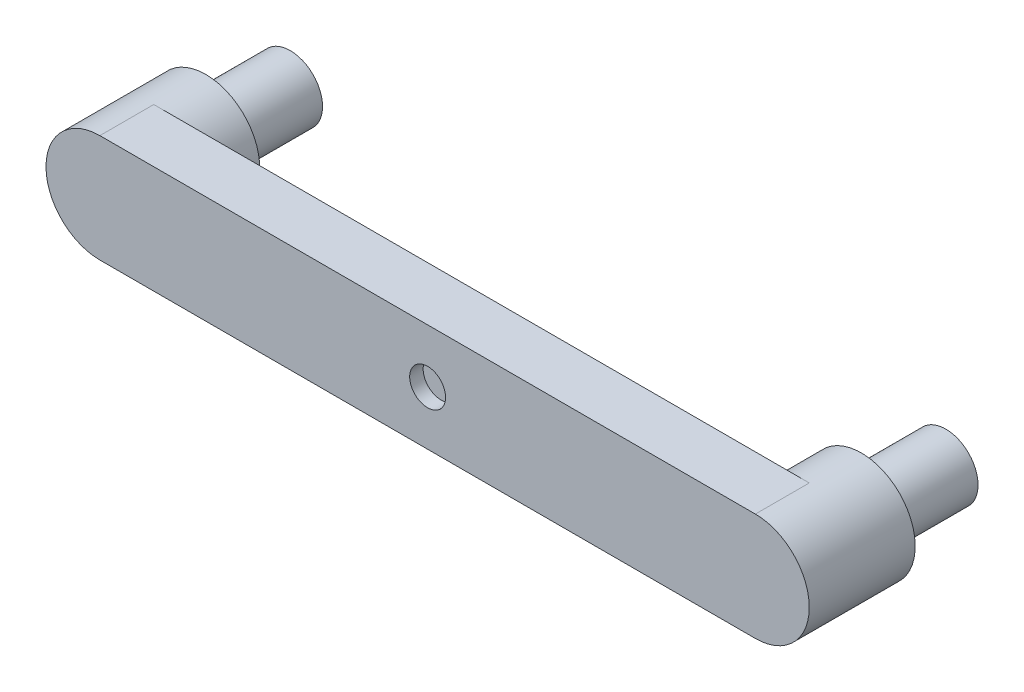
ISO-10303-21;
HEADER;
FILE_DESCRIPTION(('STEP AP214'),'2;1');
FILE_NAME('part.step','',(''),(''),'','','');
FILE_SCHEMA(('AUTOMOTIVE_DESIGN { 1 0 10303 214 1 1 1 1 }'));
ENDSEC;
DATA;
#1=APPLICATION_CONTEXT('core data for automotive mechanical design processes');
#2=APPLICATION_PROTOCOL_DEFINITION('international standard','automotive_design',2000,#1);
#3=PRODUCT_CONTEXT('',#1,'mechanical');
#4=PRODUCT('Part','Part','',(#3));
#5=PRODUCT_RELATED_PRODUCT_CATEGORY('part','',(#4));
#6=PRODUCT_DEFINITION_FORMATION('','',#4);
#7=PRODUCT_DEFINITION_CONTEXT('part definition',#1,'design');
#8=PRODUCT_DEFINITION('design','',#6,#7);
#9=PRODUCT_DEFINITION_SHAPE('','',#8);
#10=(LENGTH_UNIT() NAMED_UNIT(*) SI_UNIT(.MILLI.,.METRE.));
#11=(NAMED_UNIT(*) PLANE_ANGLE_UNIT() SI_UNIT($,.RADIAN.));
#12=(NAMED_UNIT(*) SI_UNIT($,.STERADIAN.) SOLID_ANGLE_UNIT());
#13=UNCERTAINTY_MEASURE_WITH_UNIT(LENGTH_MEASURE(1.E-05),#10,'distance_accuracy_value','');
#14=(GEOMETRIC_REPRESENTATION_CONTEXT(3) GLOBAL_UNCERTAINTY_ASSIGNED_CONTEXT((#13)) GLOBAL_UNIT_ASSIGNED_CONTEXT((#10,
#11,#12)) REPRESENTATION_CONTEXT('',''));
#15=CARTESIAN_POINT('',(0.,0.,0.));
#16=DIRECTION('',(0.,0.,1.));
#17=DIRECTION('',(1.,0.,0.));
#18=AXIS2_PLACEMENT_3D('',#15,#16,#17);
#19=CARTESIAN_POINT('',(0.,0.,-58.2842712474619));
#20=DIRECTION('',(0.,0.,1.));
#21=DIRECTION('',(1.,0.,0.));
#22=AXIS2_PLACEMENT_3D('',#19,#20,#21);
#23=CYLINDRICAL_SURFACE('',#22,10.);
#24=CARTESIAN_POINT('',(0.,0.,-7.50000000000001));
#25=DIRECTION('',(0.,0.,1.));
#26=DIRECTION('',(1.,0.,0.));
#27=AXIS2_PLACEMENT_3D('',#24,#25,#26);
#28=CIRCLE('',#27,10.);
#29=CARTESIAN_POINT('',(10.,0.,-7.50000000000001));
#30=VERTEX_POINT('',#29);
#31=EDGE_CURVE('E45',#30,#30,#28,.F.);
#32=ORIENTED_EDGE('',*,*,#31,.T.);
#33=EDGE_LOOP('',(#32));
#34=FACE_BOUND('',#33,.T.);
#35=CARTESIAN_POINT('',(0.,0.,0.));
#36=DIRECTION('',(0.,0.,1.));
#37=DIRECTION('',(1.,0.,0.));
#38=AXIS2_PLACEMENT_3D('',#35,#36,#37);
#39=CIRCLE('',#38,10.);
#40=CARTESIAN_POINT('',(10.,0.,0.));
#41=VERTEX_POINT('',#40);
#42=EDGE_CURVE('E170',#41,#41,#39,.T.);
#43=ORIENTED_EDGE('',*,*,#42,.T.);
#44=EDGE_LOOP('',(#43));
#45=FACE_BOUND('',#44,.T.);
#46=ADVANCED_FACE('F41',(#34,#45),#23,.F.);
#47=CARTESIAN_POINT('',(0.,-30.,-30.));
#48=DIRECTION('',(0.,-1.,0.));
#49=DIRECTION('',(1.,0.,0.));
#50=AXIS2_PLACEMENT_3D('',#47,#48,#49);
#51=PLANE('',#50);
#52=DIRECTION('',(0.,0.,-1.));
#53=VECTOR('',#52,1.);
#54=CARTESIAN_POINT('',(-30.,-30.,-22.5));
#55=LINE('',#54,#53);
#56=CARTESIAN_POINT('',(-30.,-30.,-7.50000000000001));
#57=VERTEX_POINT('',#56);
#58=CARTESIAN_POINT('',(-30.,-30.,-22.5));
#59=VERTEX_POINT('',#58);
#60=EDGE_CURVE('E59',#57,#59,#55,.T.);
#61=ORIENTED_EDGE('',*,*,#60,.F.);
#62=DIRECTION('',(-1.,0.,0.));
#63=VECTOR('',#62,1.);
#64=CARTESIAN_POINT('',(-30.,-30.,-7.50000000000001));
#65=LINE('',#64,#63);
#66=CARTESIAN_POINT('',(30.,-30.,-7.50000000000001));
#67=VERTEX_POINT('',#66);
#68=EDGE_CURVE('E153',#67,#57,#65,.T.);
#69=ORIENTED_EDGE('',*,*,#68,.F.);
#70=DIRECTION('',(0.,0.,1.));
#71=VECTOR('',#70,1.);
#72=CARTESIAN_POINT('',(30.,-30.,-22.5));
#73=LINE('',#72,#71);
#74=CARTESIAN_POINT('',(30.,-30.,-22.5));
#75=VERTEX_POINT('',#74);
#76=EDGE_CURVE('E242',#75,#67,#73,.T.);
#77=ORIENTED_EDGE('',*,*,#76,.F.);
#78=DIRECTION('',(1.,0.,0.));
#79=VECTOR('',#78,1.);
#80=CARTESIAN_POINT('',(-30.,-30.,-22.5));
#81=LINE('',#80,#79);
#82=EDGE_CURVE('E250',#59,#75,#81,.T.);
#83=ORIENTED_EDGE('',*,*,#82,.F.);
#84=EDGE_LOOP('',(#61,#69,#77,#83));
#85=FACE_BOUND('',#84,.T.);
#86=DIRECTION('',(1.,0.,0.));
#87=VECTOR('',#86,1.);
#88=CARTESIAN_POINT('',(0.,-30.,0.));
#89=LINE('',#88,#87);
#90=CARTESIAN_POINT('',(-182.5,-30.,0.));
#91=VERTEX_POINT('',#90);
#92=CARTESIAN_POINT('',(182.5,-29.9999999999999,0.));
#93=VERTEX_POINT('',#92);
#94=EDGE_CURVE('E102',#91,#93,#89,.T.);
#95=ORIENTED_EDGE('',*,*,#94,.F.);
#96=DIRECTION('',(0.,0.,1.));
#97=VECTOR('',#96,1.);
#98=CARTESIAN_POINT('',(-182.5,-30.,-30.));
#99=LINE('',#98,#97);
#100=CARTESIAN_POINT('',(-182.5,-30.,-30.));
#101=VERTEX_POINT('',#100);
#102=EDGE_CURVE('E88',#101,#91,#99,.T.);
#103=ORIENTED_EDGE('',*,*,#102,.F.);
#104=DIRECTION('',(1.,0.,0.));
#105=VECTOR('',#104,1.);
#106=CARTESIAN_POINT('',(0.,-30.,-30.));
#107=LINE('',#106,#105);
#108=CARTESIAN_POINT('',(182.5,-29.9999999999999,-30.));
#109=VERTEX_POINT('',#108);
#110=EDGE_CURVE('E117',#101,#109,#107,.T.);
#111=ORIENTED_EDGE('',*,*,#110,.T.);
#112=DIRECTION('',(0.,0.,1.));
#113=VECTOR('',#112,1.);
#114=CARTESIAN_POINT('',(182.5,-29.9999999999999,-30.));
#115=LINE('',#114,#113);
#116=EDGE_CURVE('E104',#109,#93,#115,.T.);
#117=ORIENTED_EDGE('',*,*,#116,.T.);
#118=EDGE_LOOP('',(#95,#103,#111,#117));
#119=FACE_BOUND('',#118,.T.);
#120=ADVANCED_FACE('F43',(#85,#119),#51,.T.);
#121=CARTESIAN_POINT('',(-182.5,0.,-30.));
#122=DIRECTION('',(0.,0.,1.));
#123=DIRECTION('',(1.,0.,0.));
#124=AXIS2_PLACEMENT_3D('',#121,#122,#123);
#125=CYLINDRICAL_SURFACE('',#124,30.);
#126=CARTESIAN_POINT('',(-182.5,0.,0.));
#127=DIRECTION('',(0.,0.,1.));
#128=DIRECTION('',(1.,0.,0.));
#129=AXIS2_PLACEMENT_3D('',#126,#127,#128);
#130=CIRCLE('',#129,30.);
#131=CARTESIAN_POINT('',(-182.5,30.,0.));
#132=VERTEX_POINT('',#131);
#133=EDGE_CURVE('E93',#132,#91,#130,.T.);
#134=ORIENTED_EDGE('',*,*,#133,.F.);
#135=DIRECTION('',(0.,0.,1.));
#136=VECTOR('',#135,1.);
#137=CARTESIAN_POINT('',(-182.5,30.,-30.));
#138=LINE('',#137,#136);
#139=CARTESIAN_POINT('',(-182.5,30.,-30.));
#140=VERTEX_POINT('',#139);
#141=EDGE_CURVE('E99',#140,#132,#138,.T.);
#142=ORIENTED_EDGE('',*,*,#141,.F.);
#143=CARTESIAN_POINT('',(-182.5,0.,-30.));
#144=DIRECTION('',(0.,0.,-1.));
#145=DIRECTION('',(-1.,0.,0.));
#146=AXIS2_PLACEMENT_3D('',#143,#144,#145);
#147=CIRCLE('',#146,30.);
#148=EDGE_CURVE('E68',#140,#101,#147,.T.);
#149=ORIENTED_EDGE('',*,*,#148,.T.);
#150=ORIENTED_EDGE('',*,*,#102,.T.);
#151=EDGE_LOOP('',(#134,#142,#149,#150));
#152=FACE_BOUND('',#151,.T.);
#153=CARTESIAN_POINT('',(-182.5,0.,-59.));
#154=DIRECTION('',(0.,0.,-1.));
#155=DIRECTION('',(-1.,0.,0.));
#156=AXIS2_PLACEMENT_3D('',#153,#154,#155);
#157=CIRCLE('',#156,30.);
#158=CARTESIAN_POINT('',(-212.5,0.,-59.));
#159=VERTEX_POINT('',#158);
#160=EDGE_CURVE('E181',#159,#159,#157,.T.);
#161=ORIENTED_EDGE('',*,*,#160,.F.);
#162=EDGE_LOOP('',(#161));
#163=FACE_BOUND('',#162,.T.);
#164=ADVANCED_FACE('F90',(#152,#163),#125,.T.);
#165=CARTESIAN_POINT('',(0.,30.,-30.));
#166=DIRECTION('',(0.,-1.,0.));
#167=DIRECTION('',(1.,0.,0.));
#168=AXIS2_PLACEMENT_3D('',#165,#166,#167);
#169=PLANE('',#168);
#170=DIRECTION('',(1.,0.,0.));
#171=VECTOR('',#170,1.);
#172=CARTESIAN_POINT('',(0.,30.,0.));
#173=LINE('',#172,#171);
#174=CARTESIAN_POINT('',(182.5,30.0000000000001,0.));
#175=VERTEX_POINT('',#174);
#176=EDGE_CURVE('E115',#132,#175,#173,.T.);
#177=ORIENTED_EDGE('',*,*,#176,.T.);
#178=DIRECTION('',(0.,0.,1.));
#179=VECTOR('',#178,1.);
#180=CARTESIAN_POINT('',(182.5,30.0000000000001,-30.));
#181=LINE('',#180,#179);
#182=CARTESIAN_POINT('',(182.5,30.0000000000001,-30.));
#183=VERTEX_POINT('',#182);
#184=EDGE_CURVE('E128',#183,#175,#181,.T.);
#185=ORIENTED_EDGE('',*,*,#184,.F.);
#186=DIRECTION('',(1.,0.,0.));
#187=VECTOR('',#186,1.);
#188=CARTESIAN_POINT('',(0.,30.,-30.));
#189=LINE('',#188,#187);
#190=EDGE_CURVE('E121',#140,#183,#189,.T.);
#191=ORIENTED_EDGE('',*,*,#190,.F.);
#192=ORIENTED_EDGE('',*,*,#141,.T.);
#193=EDGE_LOOP('',(#177,#185,#191,#192));
#194=FACE_BOUND('',#193,.T.);
#195=ADVANCED_FACE('F201',(#194),#169,.F.);
#196=CARTESIAN_POINT('',(182.5,0.,-30.));
#197=DIRECTION('',(0.,0.,1.));
#198=DIRECTION('',(1.,0.,0.));
#199=AXIS2_PLACEMENT_3D('',#196,#197,#198);
#200=CYLINDRICAL_SURFACE('',#199,30.);
#201=CARTESIAN_POINT('',(182.5,0.,0.));
#202=DIRECTION('',(0.,0.,1.));
#203=DIRECTION('',(1.,0.,0.));
#204=AXIS2_PLACEMENT_3D('',#201,#202,#203);
#205=CIRCLE('',#204,30.);
#206=EDGE_CURVE('E109',#93,#175,#205,.T.);
#207=ORIENTED_EDGE('',*,*,#206,.F.);
#208=ORIENTED_EDGE('',*,*,#116,.F.);
#209=CARTESIAN_POINT('',(182.5,0.,-30.));
#210=DIRECTION('',(0.,0.,-1.));
#211=DIRECTION('',(-1.,0.,0.));
#212=AXIS2_PLACEMENT_3D('',#209,#210,#211);
#213=CIRCLE('',#212,30.);
#214=EDGE_CURVE('E98',#109,#183,#213,.T.);
#215=ORIENTED_EDGE('',*,*,#214,.T.);
#216=ORIENTED_EDGE('',*,*,#184,.T.);
#217=EDGE_LOOP('',(#207,#208,#215,#216));
#218=FACE_BOUND('',#217,.T.);
#219=CARTESIAN_POINT('',(182.5,0.,-59.));
#220=DIRECTION('',(0.,0.,-1.));
#221=DIRECTION('',(-1.,0.,0.));
#222=AXIS2_PLACEMENT_3D('',#219,#220,#221);
#223=CIRCLE('',#222,30.);
#224=CARTESIAN_POINT('',(152.5,0.,-59.));
#225=VERTEX_POINT('',#224);
#226=EDGE_CURVE('E110',#225,#225,#223,.T.);
#227=ORIENTED_EDGE('',*,*,#226,.F.);
#228=EDGE_LOOP('',(#227));
#229=FACE_BOUND('',#228,.T.);
#230=ADVANCED_FACE('F196',(#218,#229),#200,.T.);
#231=CARTESIAN_POINT('',(0.,0.,-30.));
#232=DIRECTION('',(0.,0.,1.));
#233=DIRECTION('',(1.,0.,0.));
#234=AXIS2_PLACEMENT_3D('',#231,#232,#233);
#235=PLANE('',#234);
#236=CARTESIAN_POINT('',(0.,0.,-30.));
#237=DIRECTION('',(0.,0.,1.));
#238=DIRECTION('',(1.,0.,0.));
#239=AXIS2_PLACEMENT_3D('',#236,#237,#238);
#240=CIRCLE('',#239,10.);
#241=CARTESIAN_POINT('',(10.,0.,-30.));
#242=VERTEX_POINT('',#241);
#243=EDGE_CURVE('E177',#242,#242,#240,.F.);
#244=ORIENTED_EDGE('',*,*,#243,.F.);
#245=EDGE_LOOP('',(#244));
#246=FACE_BOUND('',#245,.T.);
#247=ORIENTED_EDGE('',*,*,#148,.F.);
#248=ORIENTED_EDGE('',*,*,#190,.T.);
#249=ORIENTED_EDGE('',*,*,#214,.F.);
#250=ORIENTED_EDGE('',*,*,#110,.F.);
#251=EDGE_LOOP('',(#247,#248,#249,#250));
#252=FACE_BOUND('',#251,.T.);
#253=ADVANCED_FACE('F202',(#246,#252),#235,.F.);
#254=CARTESIAN_POINT('',(0.,0.,0.));
#255=DIRECTION('',(0.,0.,1.));
#256=DIRECTION('',(1.,0.,0.));
#257=AXIS2_PLACEMENT_3D('',#254,#255,#256);
#258=PLANE('',#257);
#259=ORIENTED_EDGE('',*,*,#42,.F.);
#260=EDGE_LOOP('',(#259));
#261=FACE_BOUND('',#260,.T.);
#262=ORIENTED_EDGE('',*,*,#94,.T.);
#263=ORIENTED_EDGE('',*,*,#206,.T.);
#264=ORIENTED_EDGE('',*,*,#176,.F.);
#265=ORIENTED_EDGE('',*,*,#133,.T.);
#266=EDGE_LOOP('',(#262,#263,#264,#265));
#267=FACE_BOUND('',#266,.T.);
#268=ADVANCED_FACE('F113',(#261,#267),#258,.T.);
#269=CARTESIAN_POINT('',(182.5,0.,-59.));
#270=DIRECTION('',(0.,0.,-1.));
#271=DIRECTION('',(-1.,0.,0.));
#272=AXIS2_PLACEMENT_3D('',#269,#270,#271);
#273=PLANE('',#272);
#274=CARTESIAN_POINT('',(182.5,0.,-59.));
#275=DIRECTION('',(0.,0.,-1.));
#276=DIRECTION('',(-1.,0.,0.));
#277=AXIS2_PLACEMENT_3D('',#274,#275,#276);
#278=CIRCLE('',#277,18.);
#279=CARTESIAN_POINT('',(164.5,0.,-59.));
#280=VERTEX_POINT('',#279);
#281=EDGE_CURVE('E51',#280,#280,#278,.T.);
#282=ORIENTED_EDGE('',*,*,#281,.F.);
#283=EDGE_LOOP('',(#282));
#284=FACE_BOUND('',#283,.T.);
#285=ORIENTED_EDGE('',*,*,#226,.T.);
#286=EDGE_LOOP('',(#285));
#287=FACE_BOUND('',#286,.T.);
#288=ADVANCED_FACE('F274',(#284,#287),#273,.T.);
#289=CARTESIAN_POINT('',(-182.5,0.,-59.));
#290=DIRECTION('',(0.,0.,-1.));
#291=DIRECTION('',(-1.,0.,0.));
#292=AXIS2_PLACEMENT_3D('',#289,#290,#291);
#293=PLANE('',#292);
#294=CARTESIAN_POINT('',(-182.5,0.,-59.));
#295=DIRECTION('',(0.,0.,-1.));
#296=DIRECTION('',(-1.,0.,0.));
#297=AXIS2_PLACEMENT_3D('',#294,#295,#296);
#298=CIRCLE('',#297,18.);
#299=CARTESIAN_POINT('',(-200.5,0.,-59.));
#300=VERTEX_POINT('',#299);
#301=EDGE_CURVE('E11',#300,#300,#298,.T.);
#302=ORIENTED_EDGE('',*,*,#301,.F.);
#303=EDGE_LOOP('',(#302));
#304=FACE_BOUND('',#303,.T.);
#305=ORIENTED_EDGE('',*,*,#160,.T.);
#306=EDGE_LOOP('',(#305));
#307=FACE_BOUND('',#306,.T.);
#308=ADVANCED_FACE('F280',(#304,#307),#293,.T.);
#309=CARTESIAN_POINT('',(0.,0.,-22.5));
#310=DIRECTION('',(0.,0.,-1.));
#311=DIRECTION('',(-1.,0.,0.));
#312=AXIS2_PLACEMENT_3D('',#309,#310,#311);
#313=CIRCLE('',#312,10.);
#314=CARTESIAN_POINT('',(-10.,0.,-22.5));
#315=VERTEX_POINT('',#314);
#316=EDGE_CURVE('E132',#315,#315,#313,.F.);
#317=ORIENTED_EDGE('',*,*,#316,.T.);
#318=EDGE_LOOP('',(#317));
#319=FACE_BOUND('',#318,.T.);
#320=ORIENTED_EDGE('',*,*,#243,.T.);
#321=EDGE_LOOP('',(#320));
#322=FACE_BOUND('',#321,.T.);
#323=ADVANCED_FACE('F270',(#319,#322),#23,.F.);
#324=CARTESIAN_POINT('',(182.5,0.,-106.));
#325=DIRECTION('',(0.,0.,1.));
#326=DIRECTION('',(1.,0.,0.));
#327=AXIS2_PLACEMENT_3D('',#324,#325,#326);
#328=CYLINDRICAL_SURFACE('',#327,18.);
#329=CARTESIAN_POINT('',(182.5,0.,-106.));
#330=DIRECTION('',(0.,0.,-1.));
#331=DIRECTION('',(-1.,0.,0.));
#332=AXIS2_PLACEMENT_3D('',#329,#330,#331);
#333=CIRCLE('',#332,18.);
#334=CARTESIAN_POINT('',(164.5,0.,-106.));
#335=VERTEX_POINT('',#334);
#336=EDGE_CURVE('E165',#335,#335,#333,.T.);
#337=ORIENTED_EDGE('',*,*,#336,.F.);
#338=EDGE_LOOP('',(#337));
#339=FACE_BOUND('',#338,.T.);
#340=ORIENTED_EDGE('',*,*,#281,.T.);
#341=EDGE_LOOP('',(#340));
#342=FACE_BOUND('',#341,.T.);
#343=ADVANCED_FACE('F326',(#339,#342),#328,.T.);
#344=CARTESIAN_POINT('',(182.5,0.,-106.));
#345=DIRECTION('',(0.,0.,-1.));
#346=DIRECTION('',(-1.,0.,0.));
#347=AXIS2_PLACEMENT_3D('',#344,#345,#346);
#348=PLANE('',#347);
#349=ORIENTED_EDGE('',*,*,#336,.T.);
#350=EDGE_LOOP('',(#349));
#351=FACE_BOUND('',#350,.T.);
#352=ADVANCED_FACE('F331',(#351),#348,.T.);
#353=CARTESIAN_POINT('',(-182.5,0.,-106.));
#354=DIRECTION('',(0.,0.,1.));
#355=DIRECTION('',(1.,0.,0.));
#356=AXIS2_PLACEMENT_3D('',#353,#354,#355);
#357=CYLINDRICAL_SURFACE('',#356,18.);
#358=CARTESIAN_POINT('',(-182.5,0.,-106.));
#359=DIRECTION('',(0.,0.,-1.));
#360=DIRECTION('',(-1.,0.,0.));
#361=AXIS2_PLACEMENT_3D('',#358,#359,#360);
#362=CIRCLE('',#361,18.);
#363=CARTESIAN_POINT('',(-200.5,0.,-106.));
#364=VERTEX_POINT('',#363);
#365=EDGE_CURVE('E141',#364,#364,#362,.T.);
#366=ORIENTED_EDGE('',*,*,#365,.F.);
#367=EDGE_LOOP('',(#366));
#368=FACE_BOUND('',#367,.T.);
#369=ORIENTED_EDGE('',*,*,#301,.T.);
#370=EDGE_LOOP('',(#369));
#371=FACE_BOUND('',#370,.T.);
#372=ADVANCED_FACE('F341',(#368,#371),#357,.T.);
#373=CARTESIAN_POINT('',(-182.5,0.,-106.));
#374=DIRECTION('',(0.,0.,-1.));
#375=DIRECTION('',(-1.,0.,0.));
#376=AXIS2_PLACEMENT_3D('',#373,#374,#375);
#377=PLANE('',#376);
#378=ORIENTED_EDGE('',*,*,#365,.T.);
#379=EDGE_LOOP('',(#378));
#380=FACE_BOUND('',#379,.T.);
#381=ADVANCED_FACE('F263',(#380),#377,.T.);
#382=CARTESIAN_POINT('',(-30.,15.,-7.50000000000001));
#383=DIRECTION('',(0.,0.,1.));
#384=DIRECTION('',(1.,0.,0.));
#385=AXIS2_PLACEMENT_3D('',#382,#383,#384);
#386=PLANE('',#385);
#387=ORIENTED_EDGE('',*,*,#68,.T.);
#388=DIRECTION('',(0.,-1.,0.));
#389=VECTOR('',#388,1.);
#390=CARTESIAN_POINT('',(-30.,15.,-7.50000000000001));
#391=LINE('',#390,#389);
#392=CARTESIAN_POINT('',(-30.,15.,-7.50000000000001));
#393=VERTEX_POINT('',#392);
#394=EDGE_CURVE('E135',#393,#57,#391,.T.);
#395=ORIENTED_EDGE('',*,*,#394,.F.);
#396=DIRECTION('',(-1.,0.,0.));
#397=VECTOR('',#396,1.);
#398=CARTESIAN_POINT('',(-30.,15.,-7.50000000000001));
#399=LINE('',#398,#397);
#400=CARTESIAN_POINT('',(30.,15.,-7.50000000000001));
#401=VERTEX_POINT('',#400);
#402=EDGE_CURVE('E162',#401,#393,#399,.T.);
#403=ORIENTED_EDGE('',*,*,#402,.F.);
#404=DIRECTION('',(0.,-1.,0.));
#405=VECTOR('',#404,1.);
#406=CARTESIAN_POINT('',(30.,15.,-7.50000000000001));
#407=LINE('',#406,#405);
#408=EDGE_CURVE('E142',#401,#67,#407,.T.);
#409=ORIENTED_EDGE('',*,*,#408,.T.);
#410=EDGE_LOOP('',(#387,#395,#403,#409));
#411=FACE_BOUND('',#410,.T.);
#412=ORIENTED_EDGE('',*,*,#31,.F.);
#413=EDGE_LOOP('',(#412));
#414=FACE_BOUND('',#413,.T.);
#415=ADVANCED_FACE('F260',(#411,#414),#386,.F.);
#416=CARTESIAN_POINT('',(-30.,15.,-22.5));
#417=DIRECTION('',(0.,0.,-1.));
#418=DIRECTION('',(-1.,0.,0.));
#419=AXIS2_PLACEMENT_3D('',#416,#417,#418);
#420=PLANE('',#419);
#421=ORIENTED_EDGE('',*,*,#82,.T.);
#422=DIRECTION('',(0.,-1.,0.));
#423=VECTOR('',#422,1.);
#424=CARTESIAN_POINT('',(30.,15.,-22.5));
#425=LINE('',#424,#423);
#426=CARTESIAN_POINT('',(30.,15.,-22.5));
#427=VERTEX_POINT('',#426);
#428=EDGE_CURVE('E150',#427,#75,#425,.T.);
#429=ORIENTED_EDGE('',*,*,#428,.F.);
#430=DIRECTION('',(1.,0.,0.));
#431=VECTOR('',#430,1.);
#432=CARTESIAN_POINT('',(-30.,15.,-22.5));
#433=LINE('',#432,#431);
#434=CARTESIAN_POINT('',(-30.,15.,-22.5));
#435=VERTEX_POINT('',#434);
#436=EDGE_CURVE('E228',#435,#427,#433,.T.);
#437=ORIENTED_EDGE('',*,*,#436,.F.);
#438=DIRECTION('',(0.,-1.,0.));
#439=VECTOR('',#438,1.);
#440=CARTESIAN_POINT('',(-30.,15.,-22.5));
#441=LINE('',#440,#439);
#442=EDGE_CURVE('E159',#435,#59,#441,.T.);
#443=ORIENTED_EDGE('',*,*,#442,.T.);
#444=EDGE_LOOP('',(#421,#429,#437,#443));
#445=FACE_BOUND('',#444,.T.);
#446=ORIENTED_EDGE('',*,*,#316,.F.);
#447=EDGE_LOOP('',(#446));
#448=FACE_BOUND('',#447,.T.);
#449=ADVANCED_FACE('F229',(#445,#448),#420,.F.);
#450=CARTESIAN_POINT('',(-30.,15.,-22.5));
#451=DIRECTION('',(-1.,0.,0.));
#452=DIRECTION('',(0.,-1.,0.));
#453=AXIS2_PLACEMENT_3D('',#450,#451,#452);
#454=PLANE('',#453);
#455=ORIENTED_EDGE('',*,*,#60,.T.);
#456=ORIENTED_EDGE('',*,*,#442,.F.);
#457=DIRECTION('',(0.,0.,-1.));
#458=VECTOR('',#457,1.);
#459=CARTESIAN_POINT('',(-30.,15.,-22.5));
#460=LINE('',#459,#458);
#461=EDGE_CURVE('E222',#393,#435,#460,.T.);
#462=ORIENTED_EDGE('',*,*,#461,.F.);
#463=ORIENTED_EDGE('',*,*,#394,.T.);
#464=EDGE_LOOP('',(#455,#456,#462,#463));
#465=FACE_BOUND('',#464,.T.);
#466=ADVANCED_FACE('F220',(#465),#454,.F.);
#467=CARTESIAN_POINT('',(30.,15.,-22.5));
#468=DIRECTION('',(1.,0.,0.));
#469=DIRECTION('',(0.,1.,0.));
#470=AXIS2_PLACEMENT_3D('',#467,#468,#469);
#471=PLANE('',#470);
#472=ORIENTED_EDGE('',*,*,#76,.T.);
#473=ORIENTED_EDGE('',*,*,#408,.F.);
#474=DIRECTION('',(0.,0.,1.));
#475=VECTOR('',#474,1.);
#476=CARTESIAN_POINT('',(30.,15.,-22.5));
#477=LINE('',#476,#475);
#478=EDGE_CURVE('E235',#427,#401,#477,.T.);
#479=ORIENTED_EDGE('',*,*,#478,.F.);
#480=ORIENTED_EDGE('',*,*,#428,.T.);
#481=EDGE_LOOP('',(#472,#473,#479,#480));
#482=FACE_BOUND('',#481,.T.);
#483=ADVANCED_FACE('F257',(#482),#471,.F.);
#484=CARTESIAN_POINT('',(0.,15.,0.));
#485=DIRECTION('',(0.,1.,0.));
#486=DIRECTION('',(-1.,0.,0.));
#487=AXIS2_PLACEMENT_3D('',#484,#485,#486);
#488=PLANE('',#487);
#489=ORIENTED_EDGE('',*,*,#461,.T.);
#490=ORIENTED_EDGE('',*,*,#436,.T.);
#491=ORIENTED_EDGE('',*,*,#478,.T.);
#492=ORIENTED_EDGE('',*,*,#402,.T.);
#493=EDGE_LOOP('',(#489,#490,#491,#492));
#494=FACE_BOUND('',#493,.T.);
#495=ADVANCED_FACE('F237',(#494),#488,.F.);
#496=CLOSED_SHELL('',(#46,#120,#164,#195,#230,#253,#268,#288,#308,#323,#343,#352,#372,#381,#415,
#449,#466,#483,#495));
#497=MANIFOLD_SOLID_BREP('B2',#496);
#498=ADVANCED_BREP_SHAPE_REPRESENTATION('',(#18,#497),#14);
#499=SHAPE_DEFINITION_REPRESENTATION(#9,#498);
ENDSEC;
END-ISO-10303-21;
